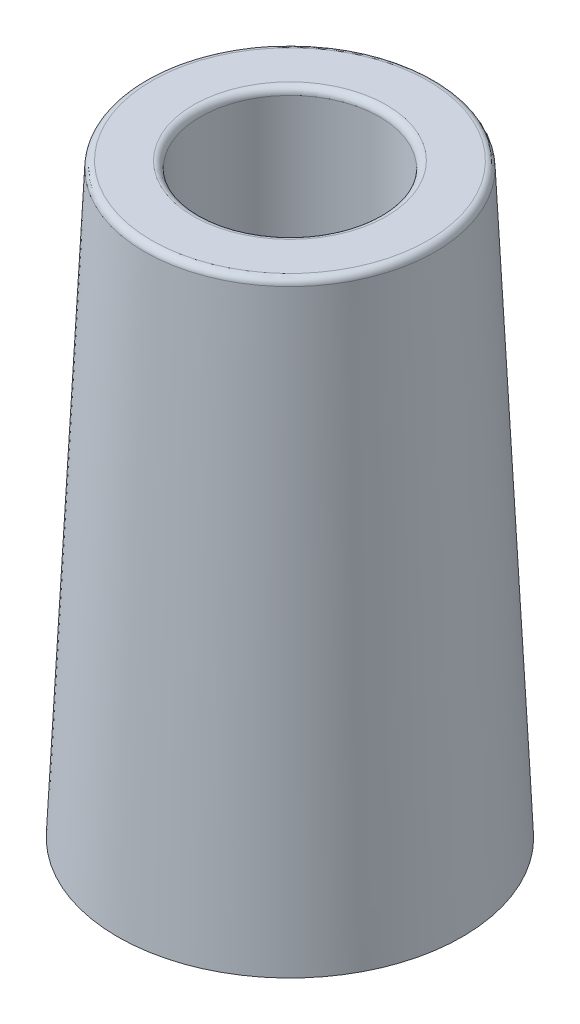
ISO-10303-21;
HEADER;
FILE_DESCRIPTION(('STEP AP214'),'2;1');
FILE_NAME('part.step','',(''),(''),'','','');
FILE_SCHEMA(('AUTOMOTIVE_DESIGN { 1 0 10303 214 1 1 1 1 }'));
ENDSEC;
DATA;
#1=APPLICATION_CONTEXT('core data for automotive mechanical design processes');
#2=APPLICATION_PROTOCOL_DEFINITION('international standard','automotive_design',2000,#1);
#3=PRODUCT_CONTEXT('',#1,'mechanical');
#4=PRODUCT('Part','Part','',(#3));
#5=PRODUCT_RELATED_PRODUCT_CATEGORY('part','',(#4));
#6=PRODUCT_DEFINITION_FORMATION('','',#4);
#7=PRODUCT_DEFINITION_CONTEXT('part definition',#1,'design');
#8=PRODUCT_DEFINITION('design','',#6,#7);
#9=PRODUCT_DEFINITION_SHAPE('','',#8);
#10=(LENGTH_UNIT() NAMED_UNIT(*) SI_UNIT(.MILLI.,.METRE.));
#11=(NAMED_UNIT(*) PLANE_ANGLE_UNIT() SI_UNIT($,.RADIAN.));
#12=(NAMED_UNIT(*) SI_UNIT($,.STERADIAN.) SOLID_ANGLE_UNIT());
#13=UNCERTAINTY_MEASURE_WITH_UNIT(LENGTH_MEASURE(1.E-05),#10,'distance_accuracy_value','');
#14=(GEOMETRIC_REPRESENTATION_CONTEXT(3) GLOBAL_UNCERTAINTY_ASSIGNED_CONTEXT((#13)) GLOBAL_UNIT_ASSIGNED_CONTEXT((#10,
#11,#12)) REPRESENTATION_CONTEXT('',''));
#15=CARTESIAN_POINT('',(0.,0.,0.));
#16=DIRECTION('',(0.,0.,1.));
#17=DIRECTION('',(1.,0.,0.));
#18=AXIS2_PLACEMENT_3D('',#15,#16,#17);
#19=CARTESIAN_POINT('',(0.,0.,0.));
#20=DIRECTION('',(0.,1.,0.));
#21=DIRECTION('',(0.,0.,1.));
#22=AXIS2_PLACEMENT_3D('',#19,#20,#21);
#23=PLANE('',#22);
#24=CARTESIAN_POINT('',(0.,0.,0.));
#25=DIRECTION('',(0.,1.,0.));
#26=DIRECTION('',(0.,0.,1.));
#27=AXIS2_PLACEMENT_3D('',#24,#25,#26);
#28=CIRCLE('',#27,25.);
#29=CARTESIAN_POINT('',(0.,0.,25.));
#30=VERTEX_POINT('',#29);
#31=EDGE_CURVE('E55',#30,#30,#28,.T.);
#32=ORIENTED_EDGE('',*,*,#31,.F.);
#33=EDGE_LOOP('',(#32));
#34=FACE_BOUND('',#33,.T.);
#35=ADVANCED_FACE('F35',(#34),#23,.F.);
#36=CARTESIAN_POINT('',(0.,85.,0.));
#37=DIRECTION('',(0.,1.,0.));
#38=DIRECTION('',(0.,0.,1.));
#39=AXIS2_PLACEMENT_3D('',#36,#37,#38);
#40=PLANE('',#39);
#41=CARTESIAN_POINT('',(0.,85.,0.));
#42=DIRECTION('',(0.,1.,0.));
#43=DIRECTION('',(0.,0.,1.));
#44=AXIS2_PLACEMENT_3D('',#41,#42,#43);
#45=CIRCLE('',#44,20.0459521694351);
#46=CARTESIAN_POINT('',(0.,85.,20.0459521694351));
#47=VERTEX_POINT('',#46);
#48=EDGE_CURVE('E46',#47,#47,#45,.T.);
#49=ORIENTED_EDGE('',*,*,#48,.T.);
#50=EDGE_LOOP('',(#49));
#51=FACE_BOUND('',#50,.T.);
#52=CARTESIAN_POINT('',(0.,85.,0.));
#53=DIRECTION('',(0.,1.,0.));
#54=DIRECTION('',(0.,0.,1.));
#55=AXIS2_PLACEMENT_3D('',#52,#53,#54);
#56=CIRCLE('',#55,14.);
#57=CARTESIAN_POINT('',(0.,85.,14.));
#58=VERTEX_POINT('',#57);
#59=EDGE_CURVE('E50',#58,#58,#56,.F.);
#60=ORIENTED_EDGE('',*,*,#59,.T.);
#61=EDGE_LOOP('',(#60));
#62=FACE_BOUND('',#61,.T.);
#63=ADVANCED_FACE('F75',(#51,#62),#40,.T.);
#64=CARTESIAN_POINT('',(0.,85.,0.));
#65=DIRECTION('',(0.,-1.,0.));
#66=DIRECTION('',(0.,0.,-1.));
#67=AXIS2_PLACEMENT_3D('',#64,#65,#66);
#68=CONICAL_SURFACE('',#67,21.,0.0470241318427463);
#69=CARTESIAN_POINT('',(0.,84.0470068032581,0.));
#70=DIRECTION('',(0.,1.,0.));
#71=DIRECTION('',(0.,0.,1.));
#72=AXIS2_PLACEMENT_3D('',#69,#70,#71);
#73=CIRCLE('',#72,21.0448467386702);
#74=CARTESIAN_POINT('',(0.,84.0470068032581,21.0448467386702));
#75=VERTEX_POINT('',#74);
#76=EDGE_CURVE('E42',#75,#75,#73,.F.);
#77=ORIENTED_EDGE('',*,*,#76,.T.);
#78=EDGE_LOOP('',(#77));
#79=FACE_BOUND('',#78,.T.);
#80=ORIENTED_EDGE('',*,*,#31,.T.);
#81=EDGE_LOOP('',(#80));
#82=FACE_BOUND('',#81,.T.);
#83=ADVANCED_FACE('F77',(#79,#82),#68,.T.);
#84=CARTESIAN_POINT('',(0.,-36.7695526217005,0.));
#85=DIRECTION('',(0.,1.,0.));
#86=DIRECTION('',(0.,0.,1.));
#87=AXIS2_PLACEMENT_3D('',#84,#85,#86);
#88=CYLINDRICAL_SURFACE('',#87,13.);
#89=CARTESIAN_POINT('',(0.,84.,0.));
#90=DIRECTION('',(0.,1.,0.));
#91=DIRECTION('',(0.,0.,1.));
#92=AXIS2_PLACEMENT_3D('',#89,#90,#91);
#93=CIRCLE('',#92,13.);
#94=CARTESIAN_POINT('',(0.,84.,13.));
#95=VERTEX_POINT('',#94);
#96=EDGE_CURVE('E12',#95,#95,#93,.T.);
#97=ORIENTED_EDGE('',*,*,#96,.T.);
#98=EDGE_LOOP('',(#97));
#99=FACE_BOUND('',#98,.T.);
#100=CARTESIAN_POINT('',(0.,4.,0.));
#101=DIRECTION('',(0.,1.,0.));
#102=DIRECTION('',(0.,0.,1.));
#103=AXIS2_PLACEMENT_3D('',#100,#101,#102);
#104=CIRCLE('',#103,13.);
#105=CARTESIAN_POINT('',(0.,4.,13.));
#106=VERTEX_POINT('',#105);
#107=EDGE_CURVE('E60',#106,#106,#104,.F.);
#108=ORIENTED_EDGE('',*,*,#107,.T.);
#109=EDGE_LOOP('',(#108));
#110=FACE_BOUND('',#109,.T.);
#111=ADVANCED_FACE('F89',(#99,#110),#88,.F.);
#112=CARTESIAN_POINT('',(0.,4.,0.));
#113=DIRECTION('',(0.,1.,0.));
#114=DIRECTION('',(0.,0.,1.));
#115=AXIS2_PLACEMENT_3D('',#112,#113,#114);
#116=PLANE('',#115);
#117=ORIENTED_EDGE('',*,*,#107,.F.);
#118=EDGE_LOOP('',(#117));
#119=FACE_BOUND('',#118,.T.);
#120=ADVANCED_FACE('F82',(#119),#116,.T.);
#121=CARTESIAN_POINT('',(0.,84.,0.));
#122=DIRECTION('',(0.,1.,0.));
#123=DIRECTION('',(0.,0.,1.));
#124=AXIS2_PLACEMENT_3D('',#121,#122,#123);
#125=TOROIDAL_SURFACE('',#124,20.0459521694351,1.);
#126=ORIENTED_EDGE('',*,*,#76,.F.);
#127=EDGE_LOOP('',(#126));
#128=FACE_BOUND('',#127,.T.);
#129=ORIENTED_EDGE('',*,*,#48,.F.);
#130=EDGE_LOOP('',(#129));
#131=FACE_BOUND('',#130,.T.);
#132=ADVANCED_FACE('F80',(#128,#131),#125,.T.);
#133=CARTESIAN_POINT('',(0.,84.,0.));
#134=DIRECTION('',(0.,1.,0.));
#135=DIRECTION('',(0.,0.,1.));
#136=AXIS2_PLACEMENT_3D('',#133,#134,#135);
#137=TOROIDAL_SURFACE('',#136,14.,1.);
#138=ORIENTED_EDGE('',*,*,#59,.F.);
#139=EDGE_LOOP('',(#138));
#140=FACE_BOUND('',#139,.T.);
#141=ORIENTED_EDGE('',*,*,#96,.F.);
#142=EDGE_LOOP('',(#141));
#143=FACE_BOUND('',#142,.T.);
#144=ADVANCED_FACE('F37',(#140,#143),#137,.T.);
#145=CLOSED_SHELL('',(#35,#63,#83,#111,#120,#132,#144));
#146=MANIFOLD_SOLID_BREP('B2',#145);
#147=ADVANCED_BREP_SHAPE_REPRESENTATION('',(#18,#146),#14);
#148=SHAPE_DEFINITION_REPRESENTATION(#9,#147);
ENDSEC;
END-ISO-10303-21;
